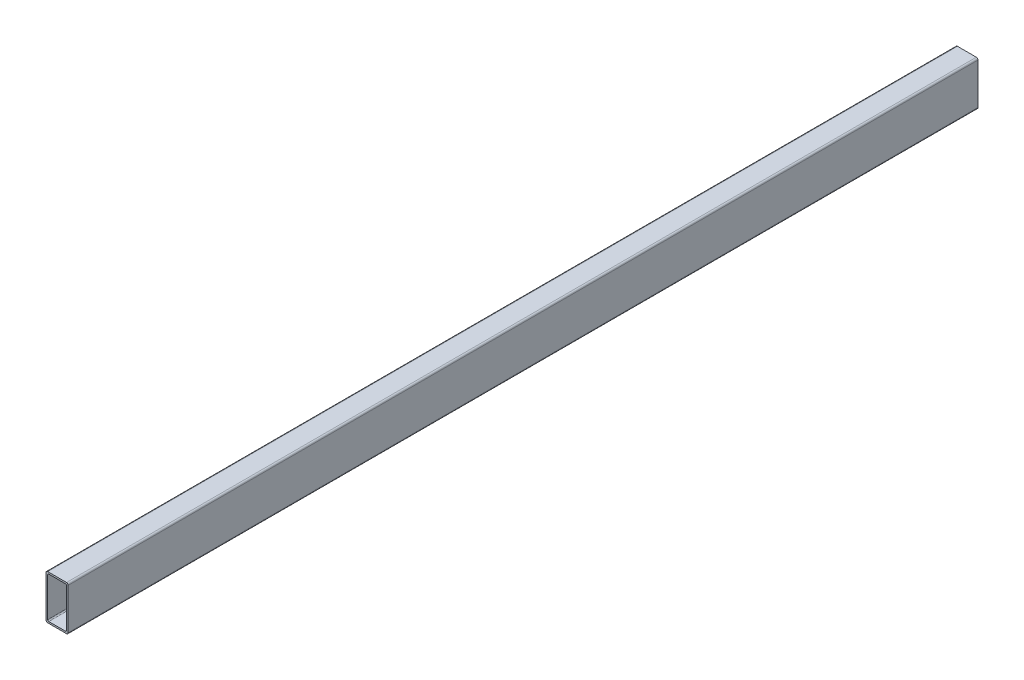
ISO-10303-21;
HEADER;
FILE_DESCRIPTION(('STEP AP214'),'2;1');
FILE_NAME('part.step','',(''),(''),'','','');
FILE_SCHEMA(('AUTOMOTIVE_DESIGN { 1 0 10303 214 1 1 1 1 }'));
ENDSEC;
DATA;
#1=APPLICATION_CONTEXT('core data for automotive mechanical design processes');
#2=APPLICATION_PROTOCOL_DEFINITION('international standard','automotive_design',2000,#1);
#3=PRODUCT_CONTEXT('',#1,'mechanical');
#4=PRODUCT('Part','Part','',(#3));
#5=PRODUCT_RELATED_PRODUCT_CATEGORY('part','',(#4));
#6=PRODUCT_DEFINITION_FORMATION('','',#4);
#7=PRODUCT_DEFINITION_CONTEXT('part definition',#1,'design');
#8=PRODUCT_DEFINITION('design','',#6,#7);
#9=PRODUCT_DEFINITION_SHAPE('','',#8);
#10=(LENGTH_UNIT() NAMED_UNIT(*) SI_UNIT(.MILLI.,.METRE.));
#11=(NAMED_UNIT(*) PLANE_ANGLE_UNIT() SI_UNIT($,.RADIAN.));
#12=(NAMED_UNIT(*) SI_UNIT($,.STERADIAN.) SOLID_ANGLE_UNIT());
#13=UNCERTAINTY_MEASURE_WITH_UNIT(LENGTH_MEASURE(1.E-05),#10,'distance_accuracy_value','');
#14=(GEOMETRIC_REPRESENTATION_CONTEXT(3) GLOBAL_UNCERTAINTY_ASSIGNED_CONTEXT((#13)) GLOBAL_UNIT_ASSIGNED_CONTEXT((#10,
#11,#12)) REPRESENTATION_CONTEXT('',''));
#15=CARTESIAN_POINT('',(0.,0.,0.));
#16=DIRECTION('',(0.,0.,1.));
#17=DIRECTION('',(1.,0.,0.));
#18=AXIS2_PLACEMENT_3D('',#15,#16,#17);
#19=CARTESIAN_POINT('',(-16.4649868837525,-40.,-454.721359549996));
#20=DIRECTION('',(0.,-1.,0.));
#21=DIRECTION('',(0.,0.,-1.));
#22=AXIS2_PLACEMENT_3D('',#19,#20,#21);
#23=PLANE('',#22);
#24=DIRECTION('',(0.,0.,1.));
#25=VECTOR('',#24,1.);
#26=CARTESIAN_POINT('',(-33.4649868837525,-40.,-454.721359549996));
#27=LINE('',#26,#25);
#28=CARTESIAN_POINT('',(-33.4649868837526,-40.,-820.));
#29=VERTEX_POINT('',#28);
#30=CARTESIAN_POINT('',(-33.4649868837525,-40.,0.));
#31=VERTEX_POINT('',#30);
#32=EDGE_CURVE('E40',#29,#31,#27,.T.);
#33=ORIENTED_EDGE('',*,*,#32,.F.);
#34=DIRECTION('',(1.,0.,0.));
#35=VECTOR('',#34,1.);
#36=CARTESIAN_POINT('',(-16.4649868837526,-40.,-820.));
#37=LINE('',#36,#35);
#38=CARTESIAN_POINT('',(-16.4649868837526,-40.,-820.));
#39=VERTEX_POINT('',#38);
#40=EDGE_CURVE('E192',#29,#39,#37,.T.);
#41=ORIENTED_EDGE('',*,*,#40,.T.);
#42=DIRECTION('',(0.,0.,1.));
#43=VECTOR('',#42,1.);
#44=CARTESIAN_POINT('',(-16.4649868837525,-40.,-454.721359549996));
#45=LINE('',#44,#43);
#46=CARTESIAN_POINT('',(-16.4649868837525,-40.,0.));
#47=VERTEX_POINT('',#46);
#48=EDGE_CURVE('E276',#39,#47,#45,.T.);
#49=ORIENTED_EDGE('',*,*,#48,.T.);
#50=DIRECTION('',(1.,0.,0.));
#51=VECTOR('',#50,1.);
#52=CARTESIAN_POINT('',(-16.4649868837525,-40.,0.));
#53=LINE('',#52,#51);
#54=EDGE_CURVE('E247',#31,#47,#53,.T.);
#55=ORIENTED_EDGE('',*,*,#54,.F.);
#56=EDGE_LOOP('',(#33,#41,#49,#55));
#57=FACE_BOUND('',#56,.T.);
#58=ADVANCED_FACE('F36',(#57),#23,.T.);
#59=CARTESIAN_POINT('',(-16.4649868837525,-38.5,-454.721359549996));
#60=DIRECTION('',(0.,0.,1.));
#61=DIRECTION('',(1.,0.,0.));
#62=AXIS2_PLACEMENT_3D('',#59,#60,#61);
#63=CYLINDRICAL_SURFACE('',#62,1.50000000000001);
#64=ORIENTED_EDGE('',*,*,#48,.F.);
#65=CARTESIAN_POINT('',(-16.4649868837526,-38.5,-820.));
#66=DIRECTION('',(0.,0.,1.));
#67=DIRECTION('',(-1.,0.,0.));
#68=AXIS2_PLACEMENT_3D('',#65,#66,#67);
#69=CIRCLE('',#68,1.50000000000001);
#70=CARTESIAN_POINT('',(-14.9649868837526,-38.5,-820.));
#71=VERTEX_POINT('',#70);
#72=EDGE_CURVE('E195',#39,#71,#69,.T.);
#73=ORIENTED_EDGE('',*,*,#72,.T.);
#74=DIRECTION('',(0.,0.,1.));
#75=VECTOR('',#74,1.);
#76=CARTESIAN_POINT('',(-14.9649868837525,-38.5,-454.721359549996));
#77=LINE('',#76,#75);
#78=CARTESIAN_POINT('',(-14.9649868837525,-38.5,0.));
#79=VERTEX_POINT('',#78);
#80=EDGE_CURVE('E275',#71,#79,#77,.T.);
#81=ORIENTED_EDGE('',*,*,#80,.T.);
#82=CARTESIAN_POINT('',(-16.4649868837525,-38.5,0.));
#83=DIRECTION('',(0.,0.,1.));
#84=DIRECTION('',(-1.,0.,0.));
#85=AXIS2_PLACEMENT_3D('',#82,#83,#84);
#86=CIRCLE('',#85,1.50000000000001);
#87=EDGE_CURVE('E250',#47,#79,#86,.T.);
#88=ORIENTED_EDGE('',*,*,#87,.F.);
#89=EDGE_LOOP('',(#64,#73,#81,#88));
#90=FACE_BOUND('',#89,.T.);
#91=ADVANCED_FACE('F305',(#90),#63,.T.);
#92=CARTESIAN_POINT('',(-14.9649868837525,-38.5,-454.721359549996));
#93=DIRECTION('',(1.,0.,0.));
#94=DIRECTION('',(0.,1.,0.));
#95=AXIS2_PLACEMENT_3D('',#92,#93,#94);
#96=PLANE('',#95);
#97=ORIENTED_EDGE('',*,*,#80,.F.);
#98=DIRECTION('',(0.,1.,0.));
#99=VECTOR('',#98,1.);
#100=CARTESIAN_POINT('',(-14.9649868837526,-38.5,-820.));
#101=LINE('',#100,#99);
#102=CARTESIAN_POINT('',(-14.9649868837526,-1.50000000000003,-820.));
#103=VERTEX_POINT('',#102);
#104=EDGE_CURVE('E198',#71,#103,#101,.T.);
#105=ORIENTED_EDGE('',*,*,#104,.T.);
#106=DIRECTION('',(0.,0.,1.));
#107=VECTOR('',#106,1.);
#108=CARTESIAN_POINT('',(-14.9649868837525,-1.50000000000002,-454.721359549996));
#109=LINE('',#108,#107);
#110=CARTESIAN_POINT('',(-14.9649868837525,-1.50000000000002,0.));
#111=VERTEX_POINT('',#110);
#112=EDGE_CURVE('E273',#103,#111,#109,.T.);
#113=ORIENTED_EDGE('',*,*,#112,.T.);
#114=DIRECTION('',(0.,1.,0.));
#115=VECTOR('',#114,1.);
#116=CARTESIAN_POINT('',(-14.9649868837525,-38.5,0.));
#117=LINE('',#116,#115);
#118=EDGE_CURVE('E253',#79,#111,#117,.T.);
#119=ORIENTED_EDGE('',*,*,#118,.F.);
#120=EDGE_LOOP('',(#97,#105,#113,#119));
#121=FACE_BOUND('',#120,.T.);
#122=ADVANCED_FACE('F302',(#121),#96,.T.);
#123=CARTESIAN_POINT('',(-16.4649868837525,-1.50000000000002,-454.721359549996));
#124=DIRECTION('',(0.,0.,1.));
#125=DIRECTION('',(1.,0.,0.));
#126=AXIS2_PLACEMENT_3D('',#123,#124,#125);
#127=CYLINDRICAL_SURFACE('',#126,1.5);
#128=ORIENTED_EDGE('',*,*,#112,.F.);
#129=CARTESIAN_POINT('',(-16.4649868837526,-1.50000000000003,-820.));
#130=DIRECTION('',(0.,0.,1.));
#131=DIRECTION('',(1.,0.,0.));
#132=AXIS2_PLACEMENT_3D('',#129,#130,#131);
#133=CIRCLE('',#132,1.5);
#134=CARTESIAN_POINT('',(-16.4649868837526,0.,-820.));
#135=VERTEX_POINT('',#134);
#136=EDGE_CURVE('E201',#103,#135,#133,.T.);
#137=ORIENTED_EDGE('',*,*,#136,.T.);
#138=DIRECTION('',(0.,0.,1.));
#139=VECTOR('',#138,1.);
#140=CARTESIAN_POINT('',(-16.4649868837525,0.,-454.721359549996));
#141=LINE('',#140,#139);
#142=CARTESIAN_POINT('',(-16.4649868837525,0.,0.));
#143=VERTEX_POINT('',#142);
#144=EDGE_CURVE('E271',#135,#143,#141,.T.);
#145=ORIENTED_EDGE('',*,*,#144,.T.);
#146=CARTESIAN_POINT('',(-16.4649868837525,-1.50000000000002,0.));
#147=DIRECTION('',(0.,0.,1.));
#148=DIRECTION('',(1.,0.,0.));
#149=AXIS2_PLACEMENT_3D('',#146,#147,#148);
#150=CIRCLE('',#149,1.5);
#151=EDGE_CURVE('E256',#111,#143,#150,.T.);
#152=ORIENTED_EDGE('',*,*,#151,.F.);
#153=EDGE_LOOP('',(#128,#137,#145,#152));
#154=FACE_BOUND('',#153,.T.);
#155=ADVANCED_FACE('F298',(#154),#127,.T.);
#156=CARTESIAN_POINT('',(-16.4649868837525,0.,-454.721359549996));
#157=DIRECTION('',(0.,1.,0.));
#158=DIRECTION('',(0.,0.,1.));
#159=AXIS2_PLACEMENT_3D('',#156,#157,#158);
#160=PLANE('',#159);
#161=ORIENTED_EDGE('',*,*,#144,.F.);
#162=DIRECTION('',(-1.,0.,0.));
#163=VECTOR('',#162,1.);
#164=CARTESIAN_POINT('',(-16.4649868837526,0.,-820.));
#165=LINE('',#164,#163);
#166=CARTESIAN_POINT('',(-33.4649868837526,0.,-820.));
#167=VERTEX_POINT('',#166);
#168=EDGE_CURVE('E204',#135,#167,#165,.T.);
#169=ORIENTED_EDGE('',*,*,#168,.T.);
#170=DIRECTION('',(0.,0.,1.));
#171=VECTOR('',#170,1.);
#172=CARTESIAN_POINT('',(-33.4649868837525,0.,-454.721359549996));
#173=LINE('',#172,#171);
#174=CARTESIAN_POINT('',(-33.4649868837525,0.,0.));
#175=VERTEX_POINT('',#174);
#176=EDGE_CURVE('E269',#167,#175,#173,.T.);
#177=ORIENTED_EDGE('',*,*,#176,.T.);
#178=DIRECTION('',(-1.,0.,0.));
#179=VECTOR('',#178,1.);
#180=CARTESIAN_POINT('',(-16.4649868837525,0.,0.));
#181=LINE('',#180,#179);
#182=EDGE_CURVE('E259',#143,#175,#181,.T.);
#183=ORIENTED_EDGE('',*,*,#182,.F.);
#184=EDGE_LOOP('',(#161,#169,#177,#183));
#185=FACE_BOUND('',#184,.T.);
#186=ADVANCED_FACE('F294',(#185),#160,.T.);
#187=CARTESIAN_POINT('',(-33.4649868837525,-1.50000000000002,-454.721359549996));
#188=DIRECTION('',(0.,0.,1.));
#189=DIRECTION('',(1.,0.,0.));
#190=AXIS2_PLACEMENT_3D('',#187,#188,#189);
#191=CYLINDRICAL_SURFACE('',#190,1.5);
#192=ORIENTED_EDGE('',*,*,#176,.F.);
#193=CARTESIAN_POINT('',(-33.4649868837526,-1.50000000000003,-820.));
#194=DIRECTION('',(0.,0.,1.));
#195=DIRECTION('',(-1.,0.,0.));
#196=AXIS2_PLACEMENT_3D('',#193,#194,#195);
#197=CIRCLE('',#196,1.5);
#198=CARTESIAN_POINT('',(-34.9649868837526,-1.50000000000003,-820.));
#199=VERTEX_POINT('',#198);
#200=EDGE_CURVE('E207',#167,#199,#197,.T.);
#201=ORIENTED_EDGE('',*,*,#200,.T.);
#202=DIRECTION('',(0.,0.,1.));
#203=VECTOR('',#202,1.);
#204=CARTESIAN_POINT('',(-34.9649868837525,-1.50000000000002,-454.721359549996));
#205=LINE('',#204,#203);
#206=CARTESIAN_POINT('',(-34.9649868837525,-1.50000000000002,0.));
#207=VERTEX_POINT('',#206);
#208=EDGE_CURVE('E45',#199,#207,#205,.T.);
#209=ORIENTED_EDGE('',*,*,#208,.T.);
#210=CARTESIAN_POINT('',(-33.4649868837525,-1.50000000000002,0.));
#211=DIRECTION('',(0.,0.,1.));
#212=DIRECTION('',(-1.,0.,0.));
#213=AXIS2_PLACEMENT_3D('',#210,#211,#212);
#214=CIRCLE('',#213,1.5);
#215=EDGE_CURVE('E262',#175,#207,#214,.T.);
#216=ORIENTED_EDGE('',*,*,#215,.F.);
#217=EDGE_LOOP('',(#192,#201,#209,#216));
#218=FACE_BOUND('',#217,.T.);
#219=ADVANCED_FACE('F291',(#218),#191,.T.);
#220=CARTESIAN_POINT('',(-34.9649868837525,-38.5,-454.721359549996));
#221=DIRECTION('',(-1.,0.,0.));
#222=DIRECTION('',(0.,-1.,0.));
#223=AXIS2_PLACEMENT_3D('',#220,#221,#222);
#224=PLANE('',#223);
#225=ORIENTED_EDGE('',*,*,#208,.F.);
#226=DIRECTION('',(0.,-1.,0.));
#227=VECTOR('',#226,1.);
#228=CARTESIAN_POINT('',(-34.9649868837526,-38.5,-820.));
#229=LINE('',#228,#227);
#230=CARTESIAN_POINT('',(-34.9649868837526,-38.5,-820.));
#231=VERTEX_POINT('',#230);
#232=EDGE_CURVE('E210',#199,#231,#229,.T.);
#233=ORIENTED_EDGE('',*,*,#232,.T.);
#234=DIRECTION('',(0.,0.,1.));
#235=VECTOR('',#234,1.);
#236=CARTESIAN_POINT('',(-34.9649868837525,-38.5,-454.721359549996));
#237=LINE('',#236,#235);
#238=CARTESIAN_POINT('',(-34.9649868837525,-38.5,0.));
#239=VERTEX_POINT('',#238);
#240=EDGE_CURVE('E11',#231,#239,#237,.T.);
#241=ORIENTED_EDGE('',*,*,#240,.T.);
#242=DIRECTION('',(0.,-1.,0.));
#243=VECTOR('',#242,1.);
#244=CARTESIAN_POINT('',(-34.9649868837525,-38.5,0.));
#245=LINE('',#244,#243);
#246=EDGE_CURVE('E265',#207,#239,#245,.T.);
#247=ORIENTED_EDGE('',*,*,#246,.F.);
#248=EDGE_LOOP('',(#225,#233,#241,#247));
#249=FACE_BOUND('',#248,.T.);
#250=ADVANCED_FACE('F286',(#249),#224,.T.);
#251=CARTESIAN_POINT('',(-33.4649868837525,-38.5,-454.721359549996));
#252=DIRECTION('',(0.,0.,1.));
#253=DIRECTION('',(1.,0.,0.));
#254=AXIS2_PLACEMENT_3D('',#251,#252,#253);
#255=CYLINDRICAL_SURFACE('',#254,1.5);
#256=ORIENTED_EDGE('',*,*,#240,.F.);
#257=CARTESIAN_POINT('',(-33.4649868837526,-38.5,-820.));
#258=DIRECTION('',(0.,0.,1.));
#259=DIRECTION('',(-1.,0.,0.));
#260=AXIS2_PLACEMENT_3D('',#257,#258,#259);
#261=CIRCLE('',#260,1.5);
#262=EDGE_CURVE('E189',#231,#29,#261,.T.);
#263=ORIENTED_EDGE('',*,*,#262,.T.);
#264=ORIENTED_EDGE('',*,*,#32,.T.);
#265=CARTESIAN_POINT('',(-33.4649868837525,-38.5,0.));
#266=DIRECTION('',(0.,0.,1.));
#267=DIRECTION('',(-1.,0.,0.));
#268=AXIS2_PLACEMENT_3D('',#265,#266,#267);
#269=CIRCLE('',#268,1.5);
#270=EDGE_CURVE('E234',#239,#31,#269,.T.);
#271=ORIENTED_EDGE('',*,*,#270,.F.);
#272=EDGE_LOOP('',(#256,#263,#264,#271));
#273=FACE_BOUND('',#272,.T.);
#274=ADVANCED_FACE('F38',(#273),#255,.T.);
#275=CARTESIAN_POINT('',(-33.4649868837525,-38.5,0.));
#276=DIRECTION('',(0.,0.,-1.));
#277=DIRECTION('',(-1.,0.,0.));
#278=AXIS2_PLACEMENT_3D('',#275,#276,#277);
#279=PLANE('',#278);
#280=DIRECTION('',(0.,-1.,0.));
#281=VECTOR('',#280,1.);
#282=CARTESIAN_POINT('',(-33.4649868837525,-37.5,0.));
#283=LINE('',#282,#281);
#284=CARTESIAN_POINT('',(-33.4649868837525,-2.50000000000002,0.));
#285=VERTEX_POINT('',#284);
#286=CARTESIAN_POINT('',(-33.4649868837525,-37.5,0.));
#287=VERTEX_POINT('',#286);
#288=EDGE_CURVE('E154',#285,#287,#283,.T.);
#289=ORIENTED_EDGE('',*,*,#288,.F.);
#290=CARTESIAN_POINT('',(-32.4649868837525,-2.50000000000002,0.));
#291=DIRECTION('',(0.,0.,1.));
#292=DIRECTION('',(-1.,0.,0.));
#293=AXIS2_PLACEMENT_3D('',#290,#291,#292);
#294=CIRCLE('',#293,0.999999999999994);
#295=CARTESIAN_POINT('',(-32.4649868837525,-1.50000000000003,0.));
#296=VERTEX_POINT('',#295);
#297=EDGE_CURVE('E212',#296,#285,#294,.T.);
#298=ORIENTED_EDGE('',*,*,#297,.F.);
#299=DIRECTION('',(-1.,0.,0.));
#300=VECTOR('',#299,1.);
#301=CARTESIAN_POINT('',(-17.4649868837525,-1.50000000000002,0.));
#302=LINE('',#301,#300);
#303=CARTESIAN_POINT('',(-17.4649868837525,-1.50000000000002,0.));
#304=VERTEX_POINT('',#303);
#305=EDGE_CURVE('E229',#304,#296,#302,.T.);
#306=ORIENTED_EDGE('',*,*,#305,.F.);
#307=CARTESIAN_POINT('',(-17.4649868837525,-2.50000000000002,0.));
#308=DIRECTION('',(0.,0.,1.));
#309=DIRECTION('',(1.,0.,0.));
#310=AXIS2_PLACEMENT_3D('',#307,#308,#309);
#311=CIRCLE('',#310,0.999999999999997);
#312=CARTESIAN_POINT('',(-16.4649868837525,-2.50000000000002,0.));
#313=VERTEX_POINT('',#312);
#314=EDGE_CURVE('E226',#313,#304,#311,.T.);
#315=ORIENTED_EDGE('',*,*,#314,.F.);
#316=DIRECTION('',(0.,1.,0.));
#317=VECTOR('',#316,1.);
#318=CARTESIAN_POINT('',(-16.4649868837525,-37.5,0.));
#319=LINE('',#318,#317);
#320=CARTESIAN_POINT('',(-16.4649868837525,-37.5,0.));
#321=VERTEX_POINT('',#320);
#322=EDGE_CURVE('E223',#321,#313,#319,.T.);
#323=ORIENTED_EDGE('',*,*,#322,.F.);
#324=CARTESIAN_POINT('',(-17.4649868837525,-37.5,0.));
#325=DIRECTION('',(0.,0.,1.));
#326=DIRECTION('',(-1.,0.,0.));
#327=AXIS2_PLACEMENT_3D('',#324,#325,#326);
#328=CIRCLE('',#327,1.);
#329=CARTESIAN_POINT('',(-17.4649868837525,-38.5,0.));
#330=VERTEX_POINT('',#329);
#331=EDGE_CURVE('E220',#330,#321,#328,.T.);
#332=ORIENTED_EDGE('',*,*,#331,.F.);
#333=DIRECTION('',(1.,0.,0.));
#334=VECTOR('',#333,1.);
#335=CARTESIAN_POINT('',(-17.4649868837525,-38.5,0.));
#336=LINE('',#335,#334);
#337=CARTESIAN_POINT('',(-32.4649868837525,-38.5,0.));
#338=VERTEX_POINT('',#337);
#339=EDGE_CURVE('E217',#338,#330,#336,.T.);
#340=ORIENTED_EDGE('',*,*,#339,.F.);
#341=CARTESIAN_POINT('',(-32.4649868837525,-37.5,0.));
#342=DIRECTION('',(0.,0.,1.));
#343=DIRECTION('',(-1.,0.,0.));
#344=AXIS2_PLACEMENT_3D('',#341,#342,#343);
#345=CIRCLE('',#344,1.);
#346=EDGE_CURVE('E215',#287,#338,#345,.T.);
#347=ORIENTED_EDGE('',*,*,#346,.F.);
#348=EDGE_LOOP('',(#289,#298,#306,#315,#323,#332,#340,#347));
#349=FACE_BOUND('',#348,.T.);
#350=ORIENTED_EDGE('',*,*,#270,.T.);
#351=ORIENTED_EDGE('',*,*,#54,.T.);
#352=ORIENTED_EDGE('',*,*,#87,.T.);
#353=ORIENTED_EDGE('',*,*,#118,.T.);
#354=ORIENTED_EDGE('',*,*,#151,.T.);
#355=ORIENTED_EDGE('',*,*,#182,.T.);
#356=ORIENTED_EDGE('',*,*,#215,.T.);
#357=ORIENTED_EDGE('',*,*,#246,.T.);
#358=EDGE_LOOP('',(#350,#351,#352,#353,#354,#355,#356,#357));
#359=FACE_BOUND('',#358,.T.);
#360=ADVANCED_FACE('F284',(#349,#359),#279,.F.);
#361=CARTESIAN_POINT('',(-33.4649868837525,-37.5,-454.721359549996));
#362=DIRECTION('',(-1.,0.,0.));
#363=DIRECTION('',(0.,-1.,0.));
#364=AXIS2_PLACEMENT_3D('',#361,#362,#363);
#365=PLANE('',#364);
#366=DIRECTION('',(0.,0.,1.));
#367=VECTOR('',#366,1.);
#368=CARTESIAN_POINT('',(-33.4649868837525,-37.5,-454.721359549996));
#369=LINE('',#368,#367);
#370=CARTESIAN_POINT('',(-33.4649868837526,-37.5,-820.));
#371=VERTEX_POINT('',#370);
#372=EDGE_CURVE('E148',#371,#287,#369,.T.);
#373=ORIENTED_EDGE('',*,*,#372,.F.);
#374=DIRECTION('',(0.,-1.,0.));
#375=VECTOR('',#374,1.);
#376=CARTESIAN_POINT('',(-33.4649868837526,-37.5,-820.));
#377=LINE('',#376,#375);
#378=CARTESIAN_POINT('',(-33.4649868837526,-2.50000000000004,-820.));
#379=VERTEX_POINT('',#378);
#380=EDGE_CURVE('E152',#379,#371,#377,.T.);
#381=ORIENTED_EDGE('',*,*,#380,.F.);
#382=DIRECTION('',(0.,0.,1.));
#383=VECTOR('',#382,1.);
#384=CARTESIAN_POINT('',(-33.4649868837525,-2.50000000000002,-454.721359549996));
#385=LINE('',#384,#383);
#386=EDGE_CURVE('E53',#379,#285,#385,.T.);
#387=ORIENTED_EDGE('',*,*,#386,.T.);
#388=ORIENTED_EDGE('',*,*,#288,.T.);
#389=EDGE_LOOP('',(#373,#381,#387,#388));
#390=FACE_BOUND('',#389,.T.);
#391=ADVANCED_FACE('F150',(#390),#365,.F.);
#392=CARTESIAN_POINT('',(-32.4649868837525,-37.5,-454.721359549996));
#393=DIRECTION('',(0.,0.,1.));
#394=DIRECTION('',(1.,0.,0.));
#395=AXIS2_PLACEMENT_3D('',#392,#393,#394);
#396=CYLINDRICAL_SURFACE('',#395,1.);
#397=DIRECTION('',(0.,0.,1.));
#398=VECTOR('',#397,1.);
#399=CARTESIAN_POINT('',(-32.4649868837525,-38.5,-454.721359549996));
#400=LINE('',#399,#398);
#401=CARTESIAN_POINT('',(-32.4649868837526,-38.5,-820.));
#402=VERTEX_POINT('',#401);
#403=EDGE_CURVE('E158',#402,#338,#400,.T.);
#404=ORIENTED_EDGE('',*,*,#403,.F.);
#405=CARTESIAN_POINT('',(-32.4649868837526,-37.5,-820.));
#406=DIRECTION('',(0.,0.,1.));
#407=DIRECTION('',(-1.,0.,0.));
#408=AXIS2_PLACEMENT_3D('',#405,#406,#407);
#409=CIRCLE('',#408,1.);
#410=EDGE_CURVE('E161',#371,#402,#409,.T.);
#411=ORIENTED_EDGE('',*,*,#410,.F.);
#412=ORIENTED_EDGE('',*,*,#372,.T.);
#413=ORIENTED_EDGE('',*,*,#346,.T.);
#414=EDGE_LOOP('',(#404,#411,#412,#413));
#415=FACE_BOUND('',#414,.T.);
#416=ADVANCED_FACE('F162',(#415),#396,.F.);
#417=CARTESIAN_POINT('',(-17.4649868837525,-38.5,-454.721359549996));
#418=DIRECTION('',(0.,-1.,0.));
#419=DIRECTION('',(1.,0.,0.));
#420=AXIS2_PLACEMENT_3D('',#417,#418,#419);
#421=PLANE('',#420);
#422=DIRECTION('',(0.,0.,1.));
#423=VECTOR('',#422,1.);
#424=CARTESIAN_POINT('',(-17.4649868837525,-38.5,-454.721359549996));
#425=LINE('',#424,#423);
#426=CARTESIAN_POINT('',(-17.4649868837526,-38.5,-820.));
#427=VERTEX_POINT('',#426);
#428=EDGE_CURVE('E241',#427,#330,#425,.T.);
#429=ORIENTED_EDGE('',*,*,#428,.F.);
#430=DIRECTION('',(1.,0.,0.));
#431=VECTOR('',#430,1.);
#432=CARTESIAN_POINT('',(-17.4649868837526,-38.5,-820.));
#433=LINE('',#432,#431);
#434=EDGE_CURVE('E166',#402,#427,#433,.T.);
#435=ORIENTED_EDGE('',*,*,#434,.F.);
#436=ORIENTED_EDGE('',*,*,#403,.T.);
#437=ORIENTED_EDGE('',*,*,#339,.T.);
#438=EDGE_LOOP('',(#429,#435,#436,#437));
#439=FACE_BOUND('',#438,.T.);
#440=ADVANCED_FACE('F334',(#439),#421,.F.);
#441=CARTESIAN_POINT('',(-17.4649868837525,-37.5,-454.721359549996));
#442=DIRECTION('',(0.,0.,1.));
#443=DIRECTION('',(1.,0.,0.));
#444=AXIS2_PLACEMENT_3D('',#441,#442,#443);
#445=CYLINDRICAL_SURFACE('',#444,1.);
#446=DIRECTION('',(0.,0.,1.));
#447=VECTOR('',#446,1.);
#448=CARTESIAN_POINT('',(-16.4649868837525,-37.5,-454.721359549996));
#449=LINE('',#448,#447);
#450=CARTESIAN_POINT('',(-16.4649868837526,-37.5,-820.));
#451=VERTEX_POINT('',#450);
#452=EDGE_CURVE('E239',#451,#321,#449,.T.);
#453=ORIENTED_EDGE('',*,*,#452,.F.);
#454=CARTESIAN_POINT('',(-17.4649868837526,-37.5,-820.));
#455=DIRECTION('',(0.,0.,1.));
#456=DIRECTION('',(-1.,0.,0.));
#457=AXIS2_PLACEMENT_3D('',#454,#455,#456);
#458=CIRCLE('',#457,1.);
#459=EDGE_CURVE('E178',#427,#451,#458,.T.);
#460=ORIENTED_EDGE('',*,*,#459,.F.);
#461=ORIENTED_EDGE('',*,*,#428,.T.);
#462=ORIENTED_EDGE('',*,*,#331,.T.);
#463=EDGE_LOOP('',(#453,#460,#461,#462));
#464=FACE_BOUND('',#463,.T.);
#465=ADVANCED_FACE('F337',(#464),#445,.F.);
#466=CARTESIAN_POINT('',(-16.4649868837525,-37.5,-454.721359549996));
#467=DIRECTION('',(1.,0.,0.));
#468=DIRECTION('',(0.,1.,0.));
#469=AXIS2_PLACEMENT_3D('',#466,#467,#468);
#470=PLANE('',#469);
#471=DIRECTION('',(0.,0.,1.));
#472=VECTOR('',#471,1.);
#473=CARTESIAN_POINT('',(-16.4649868837525,-2.50000000000002,-454.721359549996));
#474=LINE('',#473,#472);
#475=CARTESIAN_POINT('',(-16.4649868837526,-2.50000000000004,-820.));
#476=VERTEX_POINT('',#475);
#477=EDGE_CURVE('E237',#476,#313,#474,.T.);
#478=ORIENTED_EDGE('',*,*,#477,.F.);
#479=DIRECTION('',(0.,1.,0.));
#480=VECTOR('',#479,1.);
#481=CARTESIAN_POINT('',(-16.4649868837526,-37.5,-820.));
#482=LINE('',#481,#480);
#483=EDGE_CURVE('E181',#451,#476,#482,.T.);
#484=ORIENTED_EDGE('',*,*,#483,.F.);
#485=ORIENTED_EDGE('',*,*,#452,.T.);
#486=ORIENTED_EDGE('',*,*,#322,.T.);
#487=EDGE_LOOP('',(#478,#484,#485,#486));
#488=FACE_BOUND('',#487,.T.);
#489=ADVANCED_FACE('F341',(#488),#470,.F.);
#490=CARTESIAN_POINT('',(-17.4649868837525,-2.50000000000002,-454.721359549996));
#491=DIRECTION('',(0.,0.,1.));
#492=DIRECTION('',(1.,0.,0.));
#493=AXIS2_PLACEMENT_3D('',#490,#491,#492);
#494=CYLINDRICAL_SURFACE('',#493,0.999999999999997);
#495=DIRECTION('',(0.,0.,1.));
#496=VECTOR('',#495,1.);
#497=CARTESIAN_POINT('',(-17.4649868837525,-1.50000000000002,-454.721359549996));
#498=LINE('',#497,#496);
#499=CARTESIAN_POINT('',(-17.4649868837526,-1.50000000000004,-820.));
#500=VERTEX_POINT('',#499);
#501=EDGE_CURVE('E235',#500,#304,#498,.T.);
#502=ORIENTED_EDGE('',*,*,#501,.F.);
#503=CARTESIAN_POINT('',(-17.4649868837526,-2.50000000000004,-820.));
#504=DIRECTION('',(0.,0.,1.));
#505=DIRECTION('',(1.,0.,0.));
#506=AXIS2_PLACEMENT_3D('',#503,#504,#505);
#507=CIRCLE('',#506,0.999999999999997);
#508=EDGE_CURVE('E184',#476,#500,#507,.T.);
#509=ORIENTED_EDGE('',*,*,#508,.F.);
#510=ORIENTED_EDGE('',*,*,#477,.T.);
#511=ORIENTED_EDGE('',*,*,#314,.T.);
#512=EDGE_LOOP('',(#502,#509,#510,#511));
#513=FACE_BOUND('',#512,.T.);
#514=ADVANCED_FACE('F345',(#513),#494,.F.);
#515=CARTESIAN_POINT('',(-17.4649868837525,-1.50000000000002,-454.721359549996));
#516=DIRECTION('',(0.,1.,0.));
#517=DIRECTION('',(-1.,0.,0.));
#518=AXIS2_PLACEMENT_3D('',#515,#516,#517);
#519=PLANE('',#518);
#520=DIRECTION('',(0.,0.,1.));
#521=VECTOR('',#520,1.);
#522=CARTESIAN_POINT('',(-32.4649868837525,-1.50000000000003,-454.721359549996));
#523=LINE('',#522,#521);
#524=CARTESIAN_POINT('',(-32.4649868837526,-1.50000000000005,-820.));
#525=VERTEX_POINT('',#524);
#526=EDGE_CURVE('E232',#525,#296,#523,.T.);
#527=ORIENTED_EDGE('',*,*,#526,.F.);
#528=DIRECTION('',(-1.,0.,0.));
#529=VECTOR('',#528,1.);
#530=CARTESIAN_POINT('',(-17.4649868837526,-1.50000000000003,-820.));
#531=LINE('',#530,#529);
#532=EDGE_CURVE('E187',#500,#525,#531,.T.);
#533=ORIENTED_EDGE('',*,*,#532,.F.);
#534=ORIENTED_EDGE('',*,*,#501,.T.);
#535=ORIENTED_EDGE('',*,*,#305,.T.);
#536=EDGE_LOOP('',(#527,#533,#534,#535));
#537=FACE_BOUND('',#536,.T.);
#538=ADVANCED_FACE('F328',(#537),#519,.F.);
#539=CARTESIAN_POINT('',(-32.4649868837525,-2.50000000000002,-454.721359549996));
#540=DIRECTION('',(0.,0.,1.));
#541=DIRECTION('',(1.,0.,0.));
#542=AXIS2_PLACEMENT_3D('',#539,#540,#541);
#543=CYLINDRICAL_SURFACE('',#542,0.999999999999994);
#544=ORIENTED_EDGE('',*,*,#386,.F.);
#545=CARTESIAN_POINT('',(-32.4649868837526,-2.50000000000004,-820.));
#546=DIRECTION('',(0.,0.,1.));
#547=DIRECTION('',(-1.,0.,0.));
#548=AXIS2_PLACEMENT_3D('',#545,#546,#547);
#549=CIRCLE('',#548,0.999999999999994);
#550=EDGE_CURVE('E173',#525,#379,#549,.T.);
#551=ORIENTED_EDGE('',*,*,#550,.F.);
#552=ORIENTED_EDGE('',*,*,#526,.T.);
#553=ORIENTED_EDGE('',*,*,#297,.T.);
#554=EDGE_LOOP('',(#544,#551,#552,#553));
#555=FACE_BOUND('',#554,.T.);
#556=ADVANCED_FACE('F325',(#555),#543,.F.);
#557=CARTESIAN_POINT('',(-33.4649868837526,-38.5,-820.));
#558=DIRECTION('',(0.,0.,1.));
#559=DIRECTION('',(-1.,0.,0.));
#560=AXIS2_PLACEMENT_3D('',#557,#558,#559);
#561=PLANE('',#560);
#562=ORIENTED_EDGE('',*,*,#380,.T.);
#563=ORIENTED_EDGE('',*,*,#410,.T.);
#564=ORIENTED_EDGE('',*,*,#434,.T.);
#565=ORIENTED_EDGE('',*,*,#459,.T.);
#566=ORIENTED_EDGE('',*,*,#483,.T.);
#567=ORIENTED_EDGE('',*,*,#508,.T.);
#568=ORIENTED_EDGE('',*,*,#532,.T.);
#569=ORIENTED_EDGE('',*,*,#550,.T.);
#570=EDGE_LOOP('',(#562,#563,#564,#565,#566,#567,#568,#569));
#571=FACE_BOUND('',#570,.T.);
#572=ORIENTED_EDGE('',*,*,#262,.F.);
#573=ORIENTED_EDGE('',*,*,#232,.F.);
#574=ORIENTED_EDGE('',*,*,#200,.F.);
#575=ORIENTED_EDGE('',*,*,#168,.F.);
#576=ORIENTED_EDGE('',*,*,#136,.F.);
#577=ORIENTED_EDGE('',*,*,#104,.F.);
#578=ORIENTED_EDGE('',*,*,#72,.F.);
#579=ORIENTED_EDGE('',*,*,#40,.F.);
#580=EDGE_LOOP('',(#572,#573,#574,#575,#576,#577,#578,#579));
#581=FACE_BOUND('',#580,.T.);
#582=ADVANCED_FACE('F169',(#571,#581),#561,.F.);
#583=CLOSED_SHELL('',(#58,#91,#122,#155,#186,#219,#250,#274,#360,#391,#416,#440,#465,#489,#514,
#538,#556,#582));
#584=MANIFOLD_SOLID_BREP('B2',#583);
#585=ADVANCED_BREP_SHAPE_REPRESENTATION('',(#18,#584),#14);
#586=SHAPE_DEFINITION_REPRESENTATION(#9,#585);
ENDSEC;
END-ISO-10303-21;
